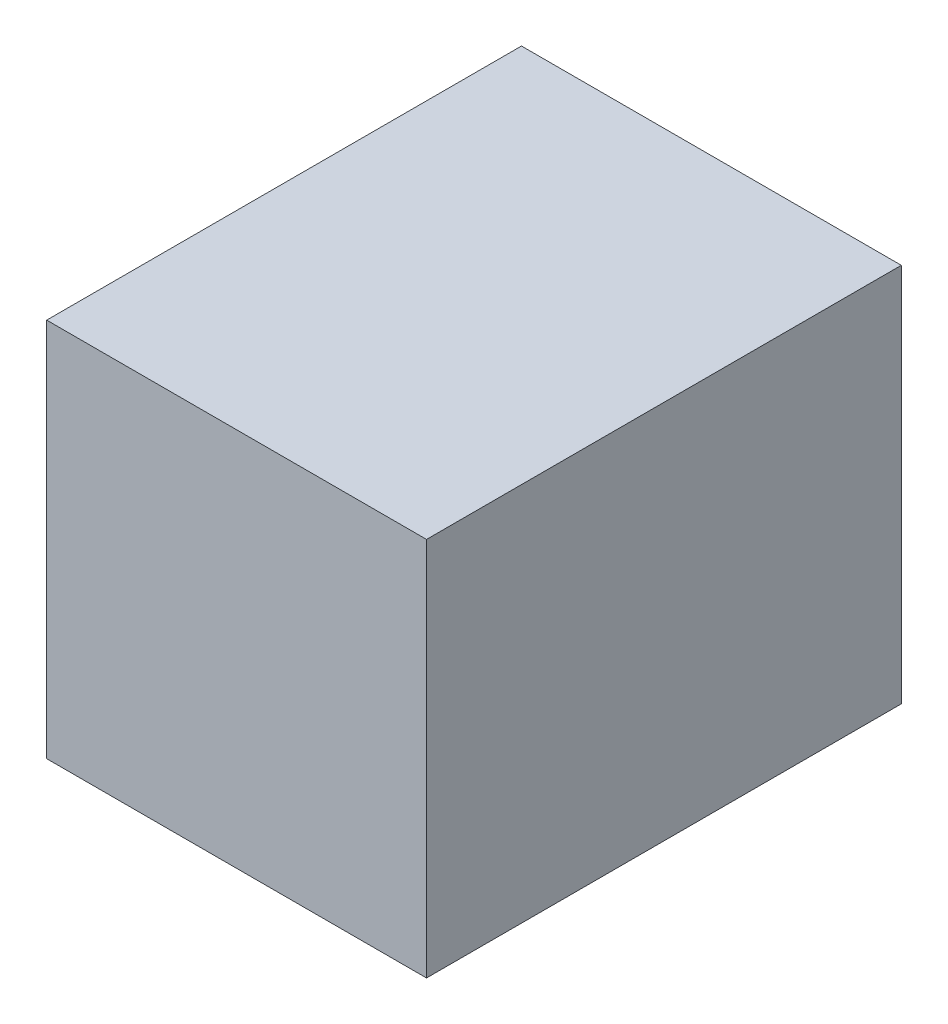
ISO-10303-21;
HEADER;
FILE_DESCRIPTION(('STEP AP214'),'2;1');
FILE_NAME('part.step','',(''),(''),'','','');
FILE_SCHEMA(('AUTOMOTIVE_DESIGN { 1 0 10303 214 1 1 1 1 }'));
ENDSEC;
DATA;
#1=APPLICATION_CONTEXT('core data for automotive mechanical design processes');
#2=APPLICATION_PROTOCOL_DEFINITION('international standard','automotive_design',2000,#1);
#3=PRODUCT_CONTEXT('',#1,'mechanical');
#4=PRODUCT('Part','Part','',(#3));
#5=PRODUCT_RELATED_PRODUCT_CATEGORY('part','',(#4));
#6=PRODUCT_DEFINITION_FORMATION('','',#4);
#7=PRODUCT_DEFINITION_CONTEXT('part definition',#1,'design');
#8=PRODUCT_DEFINITION('design','',#6,#7);
#9=PRODUCT_DEFINITION_SHAPE('','',#8);
#10=(LENGTH_UNIT() NAMED_UNIT(*) SI_UNIT(.MILLI.,.METRE.));
#11=(NAMED_UNIT(*) PLANE_ANGLE_UNIT() SI_UNIT($,.RADIAN.));
#12=(NAMED_UNIT(*) SI_UNIT($,.STERADIAN.) SOLID_ANGLE_UNIT());
#13=UNCERTAINTY_MEASURE_WITH_UNIT(LENGTH_MEASURE(1.E-05),#10,'distance_accuracy_value','');
#14=(GEOMETRIC_REPRESENTATION_CONTEXT(3) GLOBAL_UNCERTAINTY_ASSIGNED_CONTEXT((#13)) GLOBAL_UNIT_ASSIGNED_CONTEXT((#10,
#11,#12)) REPRESENTATION_CONTEXT('',''));
#15=CARTESIAN_POINT('',(0.,0.,0.));
#16=DIRECTION('',(0.,0.,1.));
#17=DIRECTION('',(1.,0.,0.));
#18=AXIS2_PLACEMENT_3D('',#15,#16,#17);
#19=CARTESIAN_POINT('',(-8.,8.,20.));
#20=DIRECTION('',(1.,0.,0.));
#21=DIRECTION('',(0.,0.,-1.));
#22=AXIS2_PLACEMENT_3D('',#19,#20,#21);
#23=PLANE('',#22);
#24=DIRECTION('',(0.,-1.,0.));
#25=VECTOR('',#24,1.);
#26=CARTESIAN_POINT('',(-8.,8.,0.));
#27=LINE('',#26,#25);
#28=CARTESIAN_POINT('',(-8.,8.,0.));
#29=VERTEX_POINT('',#28);
#30=CARTESIAN_POINT('',(-8.,-8.,0.));
#31=VERTEX_POINT('',#30);
#32=EDGE_CURVE('E66',#29,#31,#27,.T.);
#33=ORIENTED_EDGE('',*,*,#32,.T.);
#34=DIRECTION('',(0.,0.,-1.));
#35=VECTOR('',#34,1.);
#36=CARTESIAN_POINT('',(-8.,-8.,20.));
#37=LINE('',#36,#35);
#38=CARTESIAN_POINT('',(-8.,-8.,20.));
#39=VERTEX_POINT('',#38);
#40=EDGE_CURVE('E91',#39,#31,#37,.T.);
#41=ORIENTED_EDGE('',*,*,#40,.F.);
#42=DIRECTION('',(0.,-1.,0.));
#43=VECTOR('',#42,1.);
#44=CARTESIAN_POINT('',(-8.,8.,20.));
#45=LINE('',#44,#43);
#46=CARTESIAN_POINT('',(-8.,8.,20.));
#47=VERTEX_POINT('',#46);
#48=EDGE_CURVE('E83',#47,#39,#45,.T.);
#49=ORIENTED_EDGE('',*,*,#48,.F.);
#50=DIRECTION('',(0.,0.,-1.));
#51=VECTOR('',#50,1.);
#52=CARTESIAN_POINT('',(-8.,8.,20.));
#53=LINE('',#52,#51);
#54=EDGE_CURVE('E88',#47,#29,#53,.T.);
#55=ORIENTED_EDGE('',*,*,#54,.T.);
#56=EDGE_LOOP('',(#33,#41,#49,#55));
#57=FACE_BOUND('',#56,.T.);
#58=CARTESIAN_POINT('',(-8.,0.,10.));
#59=DIRECTION('',(1.,0.,0.));
#60=DIRECTION('',(0.,0.,-1.));
#61=AXIS2_PLACEMENT_3D('',#58,#59,#60);
#62=CIRCLE('',#61,2.);
#63=CARTESIAN_POINT('',(-8.,0.,8.));
#64=VERTEX_POINT('',#63);
#65=EDGE_CURVE('E11',#64,#64,#62,.F.);
#66=ORIENTED_EDGE('',*,*,#65,.F.);
#67=EDGE_LOOP('',(#66));
#68=FACE_BOUND('',#67,.T.);
#69=ADVANCED_FACE('F32',(#57,#68),#23,.F.);
#70=CARTESIAN_POINT('',(8.,8.,20.));
#71=DIRECTION('',(-1.,0.,0.));
#72=DIRECTION('',(0.,0.,1.));
#73=AXIS2_PLACEMENT_3D('',#70,#71,#72);
#74=PLANE('',#73);
#75=DIRECTION('',(0.,1.,0.));
#76=VECTOR('',#75,1.);
#77=CARTESIAN_POINT('',(8.,8.,0.));
#78=LINE('',#77,#76);
#79=CARTESIAN_POINT('',(8.,-8.,0.));
#80=VERTEX_POINT('',#79);
#81=CARTESIAN_POINT('',(8.,8.,0.));
#82=VERTEX_POINT('',#81);
#83=EDGE_CURVE('E99',#80,#82,#78,.T.);
#84=ORIENTED_EDGE('',*,*,#83,.T.);
#85=DIRECTION('',(0.,0.,-1.));
#86=VECTOR('',#85,1.);
#87=CARTESIAN_POINT('',(8.,8.,20.));
#88=LINE('',#87,#86);
#89=CARTESIAN_POINT('',(8.,8.,20.));
#90=VERTEX_POINT('',#89);
#91=EDGE_CURVE('E41',#90,#82,#88,.T.);
#92=ORIENTED_EDGE('',*,*,#91,.F.);
#93=DIRECTION('',(0.,1.,0.));
#94=VECTOR('',#93,1.);
#95=CARTESIAN_POINT('',(8.,8.,20.));
#96=LINE('',#95,#94);
#97=CARTESIAN_POINT('',(8.,-8.,20.));
#98=VERTEX_POINT('',#97);
#99=EDGE_CURVE('E85',#98,#90,#96,.T.);
#100=ORIENTED_EDGE('',*,*,#99,.F.);
#101=DIRECTION('',(0.,0.,-1.));
#102=VECTOR('',#101,1.);
#103=CARTESIAN_POINT('',(8.,-8.,20.));
#104=LINE('',#103,#102);
#105=EDGE_CURVE('E95',#98,#80,#104,.T.);
#106=ORIENTED_EDGE('',*,*,#105,.T.);
#107=EDGE_LOOP('',(#84,#92,#100,#106));
#108=FACE_BOUND('',#107,.T.);
#109=ADVANCED_FACE('F34',(#108),#74,.F.);
#110=CARTESIAN_POINT('',(-8.,8.,20.));
#111=DIRECTION('',(0.,-1.,0.));
#112=DIRECTION('',(0.,0.,-1.));
#113=AXIS2_PLACEMENT_3D('',#110,#111,#112);
#114=PLANE('',#113);
#115=DIRECTION('',(-1.,0.,0.));
#116=VECTOR('',#115,1.);
#117=CARTESIAN_POINT('',(-8.,8.,0.));
#118=LINE('',#117,#116);
#119=EDGE_CURVE('E90',#82,#29,#118,.T.);
#120=ORIENTED_EDGE('',*,*,#119,.T.);
#121=ORIENTED_EDGE('',*,*,#54,.F.);
#122=DIRECTION('',(-1.,0.,0.));
#123=VECTOR('',#122,1.);
#124=CARTESIAN_POINT('',(-8.,8.,20.));
#125=LINE('',#124,#123);
#126=EDGE_CURVE('E80',#90,#47,#125,.T.);
#127=ORIENTED_EDGE('',*,*,#126,.F.);
#128=ORIENTED_EDGE('',*,*,#91,.T.);
#129=EDGE_LOOP('',(#120,#121,#127,#128));
#130=FACE_BOUND('',#129,.T.);
#131=ADVANCED_FACE('F89',(#130),#114,.F.);
#132=CARTESIAN_POINT('',(-8.,-8.,20.));
#133=DIRECTION('',(0.,1.,0.));
#134=DIRECTION('',(0.,0.,1.));
#135=AXIS2_PLACEMENT_3D('',#132,#133,#134);
#136=PLANE('',#135);
#137=DIRECTION('',(1.,0.,0.));
#138=VECTOR('',#137,1.);
#139=CARTESIAN_POINT('',(-8.,-8.,0.));
#140=LINE('',#139,#138);
#141=EDGE_CURVE('E72',#31,#80,#140,.T.);
#142=ORIENTED_EDGE('',*,*,#141,.T.);
#143=ORIENTED_EDGE('',*,*,#105,.F.);
#144=DIRECTION('',(1.,0.,0.));
#145=VECTOR('',#144,1.);
#146=CARTESIAN_POINT('',(-8.,-8.,20.));
#147=LINE('',#146,#145);
#148=EDGE_CURVE('E49',#39,#98,#147,.T.);
#149=ORIENTED_EDGE('',*,*,#148,.F.);
#150=ORIENTED_EDGE('',*,*,#40,.T.);
#151=EDGE_LOOP('',(#142,#143,#149,#150));
#152=FACE_BOUND('',#151,.T.);
#153=ADVANCED_FACE('F121',(#152),#136,.F.);
#154=CARTESIAN_POINT('',(0.,0.,20.));
#155=DIRECTION('',(0.,0.,1.));
#156=DIRECTION('',(1.,0.,0.));
#157=AXIS2_PLACEMENT_3D('',#154,#155,#156);
#158=PLANE('',#157);
#159=ORIENTED_EDGE('',*,*,#99,.T.);
#160=ORIENTED_EDGE('',*,*,#126,.T.);
#161=ORIENTED_EDGE('',*,*,#48,.T.);
#162=ORIENTED_EDGE('',*,*,#148,.T.);
#163=EDGE_LOOP('',(#159,#160,#161,#162));
#164=FACE_BOUND('',#163,.T.);
#165=ADVANCED_FACE('F81',(#164),#158,.T.);
#166=CARTESIAN_POINT('',(0.,0.,0.));
#167=DIRECTION('',(0.,0.,1.));
#168=DIRECTION('',(1.,0.,0.));
#169=AXIS2_PLACEMENT_3D('',#166,#167,#168);
#170=PLANE('',#169);
#171=ORIENTED_EDGE('',*,*,#83,.F.);
#172=ORIENTED_EDGE('',*,*,#141,.F.);
#173=ORIENTED_EDGE('',*,*,#32,.F.);
#174=ORIENTED_EDGE('',*,*,#119,.F.);
#175=EDGE_LOOP('',(#171,#172,#173,#174));
#176=FACE_BOUND('',#175,.T.);
#177=ADVANCED_FACE('F110',(#176),#170,.F.);
#178=CARTESIAN_POINT('',(-14.,0.,10.));
#179=DIRECTION('',(1.,0.,0.));
#180=DIRECTION('',(0.,0.,-1.));
#181=AXIS2_PLACEMENT_3D('',#178,#179,#180);
#182=CYLINDRICAL_SURFACE('',#181,2.);
#183=CARTESIAN_POINT('',(-14.,0.,10.));
#184=DIRECTION('',(-1.,0.,0.));
#185=DIRECTION('',(0.,0.,1.));
#186=AXIS2_PLACEMENT_3D('',#183,#184,#185);
#187=CIRCLE('',#186,2.);
#188=CARTESIAN_POINT('',(-14.,0.,12.));
#189=VERTEX_POINT('',#188);
#190=EDGE_CURVE('E102',#189,#189,#187,.T.);
#191=ORIENTED_EDGE('',*,*,#190,.F.);
#192=EDGE_LOOP('',(#191));
#193=FACE_BOUND('',#192,.T.);
#194=ORIENTED_EDGE('',*,*,#65,.T.);
#195=EDGE_LOOP('',(#194));
#196=FACE_BOUND('',#195,.T.);
#197=ADVANCED_FACE('F112',(#193,#196),#182,.T.);
#198=CARTESIAN_POINT('',(-14.,0.,10.));
#199=DIRECTION('',(-1.,0.,0.));
#200=DIRECTION('',(0.,0.,1.));
#201=AXIS2_PLACEMENT_3D('',#198,#199,#200);
#202=PLANE('',#201);
#203=ORIENTED_EDGE('',*,*,#190,.T.);
#204=EDGE_LOOP('',(#203));
#205=FACE_BOUND('',#204,.T.);
#206=ADVANCED_FACE('F118',(#205),#202,.T.);
#207=CLOSED_SHELL('',(#69,#109,#131,#153,#165,#177,#197,#206));
#208=MANIFOLD_SOLID_BREP('B2',#207);
#209=ADVANCED_BREP_SHAPE_REPRESENTATION('',(#18,#208),#14);
#210=SHAPE_DEFINITION_REPRESENTATION(#9,#209);
ENDSEC;
END-ISO-10303-21;
